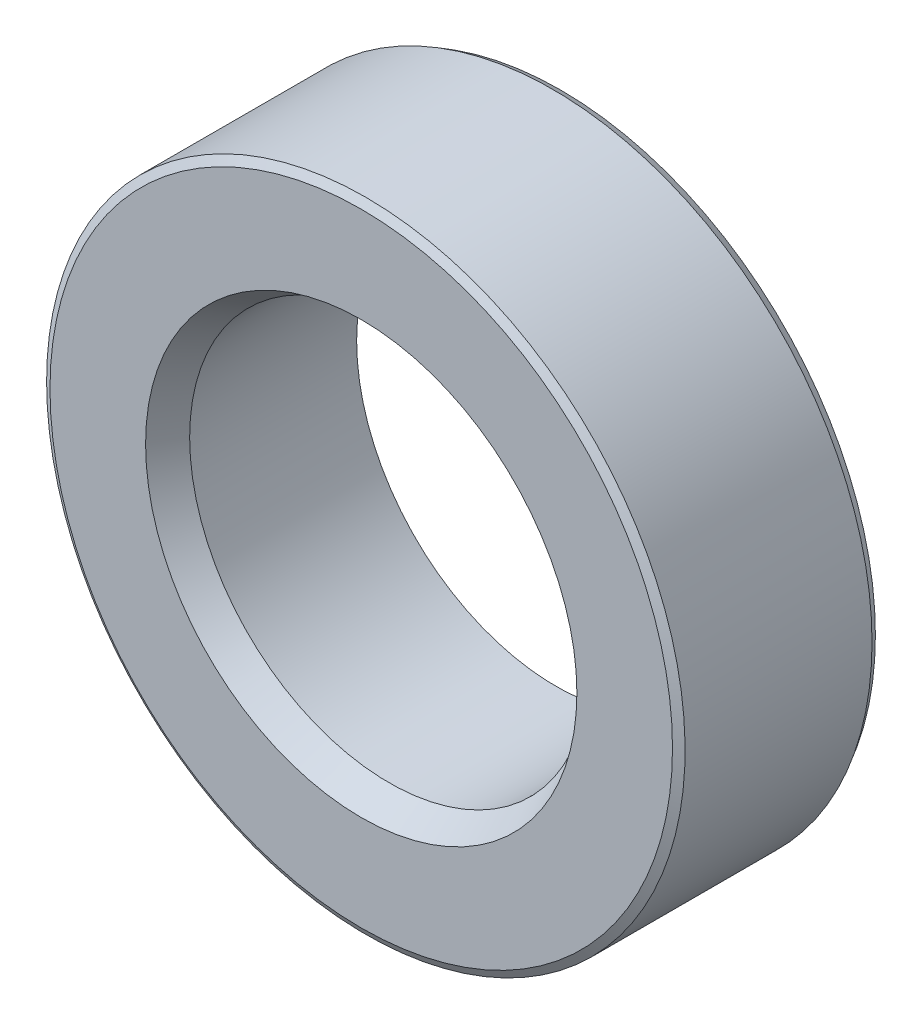
ISO-10303-21;
HEADER;
FILE_DESCRIPTION(('STEP AP214'),'2;1');
FILE_NAME('part.step','',(''),(''),'','','');
FILE_SCHEMA(('AUTOMOTIVE_DESIGN { 1 0 10303 214 1 1 1 1 }'));
ENDSEC;
DATA;
#1=APPLICATION_CONTEXT('core data for automotive mechanical design processes');
#2=APPLICATION_PROTOCOL_DEFINITION('international standard','automotive_design',2000,#1);
#3=PRODUCT_CONTEXT('',#1,'mechanical');
#4=PRODUCT('Part','Part','',(#3));
#5=PRODUCT_RELATED_PRODUCT_CATEGORY('part','',(#4));
#6=PRODUCT_DEFINITION_FORMATION('','',#4);
#7=PRODUCT_DEFINITION_CONTEXT('part definition',#1,'design');
#8=PRODUCT_DEFINITION('design','',#6,#7);
#9=PRODUCT_DEFINITION_SHAPE('','',#8);
#10=(LENGTH_UNIT() NAMED_UNIT(*) SI_UNIT(.MILLI.,.METRE.));
#11=(NAMED_UNIT(*) PLANE_ANGLE_UNIT() SI_UNIT($,.RADIAN.));
#12=(NAMED_UNIT(*) SI_UNIT($,.STERADIAN.) SOLID_ANGLE_UNIT());
#13=UNCERTAINTY_MEASURE_WITH_UNIT(LENGTH_MEASURE(1.E-05),#10,'distance_accuracy_value','');
#14=(GEOMETRIC_REPRESENTATION_CONTEXT(3) GLOBAL_UNCERTAINTY_ASSIGNED_CONTEXT((#13)) GLOBAL_UNIT_ASSIGNED_CONTEXT((#10,
#11,#12)) REPRESENTATION_CONTEXT('',''));
#15=CARTESIAN_POINT('',(0.,0.,0.));
#16=DIRECTION('',(0.,0.,1.));
#17=DIRECTION('',(1.,0.,0.));
#18=AXIS2_PLACEMENT_3D('',#15,#16,#17);
#19=CARTESIAN_POINT('',(0.,0.,-2.5));
#20=DIRECTION('',(0.,0.,-1.));
#21=DIRECTION('',(-1.,0.,0.));
#22=AXIS2_PLACEMENT_3D('',#19,#20,#21);
#23=CYLINDRICAL_SURFACE('',#22,2.5);
#24=CARTESIAN_POINT('',(0.,0.,-0.100000000031741));
#25=DIRECTION('',(0.,0.,1.));
#26=DIRECTION('',(-1.,0.,0.));
#27=AXIS2_PLACEMENT_3D('',#24,#25,#26);
#28=CIRCLE('',#27,2.50000000005457);
#29=CARTESIAN_POINT('',(-2.50000000005457,0.,-0.100000000031741));
#30=VERTEX_POINT('',#29);
#31=EDGE_CURVE('E35',#30,#30,#28,.T.);
#32=ORIENTED_EDGE('',*,*,#31,.T.);
#33=EDGE_LOOP('',(#32));
#34=FACE_BOUND('',#33,.T.);
#35=CARTESIAN_POINT('',(0.,0.,-2.19226497307545));
#36=DIRECTION('',(0.,0.,-1.));
#37=DIRECTION('',(1.,0.,0.));
#38=AXIS2_PLACEMENT_3D('',#35,#36,#37);
#39=CIRCLE('',#38,2.49999999999771);
#40=CARTESIAN_POINT('',(2.49999999999773,0.,-2.19226497307545));
#41=VERTEX_POINT('',#40);
#42=EDGE_CURVE('E32',#41,#41,#39,.T.);
#43=ORIENTED_EDGE('',*,*,#42,.T.);
#44=EDGE_LOOP('',(#43));
#45=FACE_BOUND('',#44,.T.);
#46=ADVANCED_FACE('F15',(#34,#45),#23,.F.);
#47=CARTESIAN_POINT('',(0.,0.,0.249999999880401));
#48=DIRECTION('',(0.,0.,1.));
#49=DIRECTION('',(1.,0.,0.));
#50=AXIS2_PLACEMENT_3D('',#47,#48,#49);
#51=CONICAL_SURFACE('',#50,2.70207259421795,0.523598775644934);
#52=CARTESIAN_POINT('',(0.,0.,0.249999999994088));
#53=DIRECTION('',(0.,0.,1.));
#54=DIRECTION('',(1.,0.,0.));
#55=AXIS2_PLACEMENT_3D('',#52,#53,#54);
#56=CIRCLE('',#55,2.70207259428359);
#57=CARTESIAN_POINT('',(2.70207259428359,0.,0.249999999994088));
#58=VERTEX_POINT('',#57);
#59=EDGE_CURVE('E18',#58,#58,#56,.F.);
#60=ORIENTED_EDGE('',*,*,#59,.F.);
#61=EDGE_LOOP('',(#60));
#62=FACE_BOUND('',#61,.T.);
#63=ORIENTED_EDGE('',*,*,#31,.F.);
#64=EDGE_LOOP('',(#63));
#65=FACE_BOUND('',#64,.T.);
#66=ADVANCED_FACE('F52',(#62,#65),#51,.F.);
#67=CARTESIAN_POINT('',(0.,0.,-2.25000000000364));
#68=DIRECTION('',(0.,0.,-1.));
#69=DIRECTION('',(-1.,0.,0.));
#70=AXIS2_PLACEMENT_3D('',#67,#68,#69);
#71=CONICAL_SURFACE('',#70,2.60000000002945,1.04719755133083);
#72=CARTESIAN_POINT('',(0.,0.,-2.25000000000365));
#73=DIRECTION('',(0.,0.,-1.));
#74=DIRECTION('',(-1.,0.,0.));
#75=AXIS2_PLACEMENT_3D('',#72,#73,#74);
#76=CIRCLE('',#75,2.60000000002947);
#77=CARTESIAN_POINT('',(-2.60000000002945,0.,-2.25000000000365));
#78=VERTEX_POINT('',#77);
#79=EDGE_CURVE('E42',#78,#78,#76,.T.);
#80=ORIENTED_EDGE('',*,*,#79,.T.);
#81=EDGE_LOOP('',(#80));
#82=FACE_BOUND('',#81,.T.);
#83=ORIENTED_EDGE('',*,*,#42,.F.);
#84=EDGE_LOOP('',(#83));
#85=FACE_BOUND('',#84,.T.);
#86=ADVANCED_FACE('F55',(#82,#85),#71,.F.);
#87=CARTESIAN_POINT('',(0.,0.,0.249999999999986));
#88=DIRECTION('',(0.,0.,1.));
#89=DIRECTION('',(0.,-1.,0.));
#90=AXIS2_PLACEMENT_3D('',#87,#88,#89);
#91=PLANE('',#90);
#92=ORIENTED_EDGE('',*,*,#59,.T.);
#93=EDGE_LOOP('',(#92));
#94=FACE_BOUND('',#93,.T.);
#95=CARTESIAN_POINT('',(0.,0.,0.250000000009319));
#96=DIRECTION('',(0.,0.,-1.));
#97=DIRECTION('',(0.,1.,0.));
#98=AXIS2_PLACEMENT_3D('',#95,#96,#97);
#99=CIRCLE('',#98,3.89999999993051);
#100=CARTESIAN_POINT('',(0.,3.89999999993048,0.250000000009319));
#101=VERTEX_POINT('',#100);
#102=EDGE_CURVE('E40',#101,#101,#99,.T.);
#103=ORIENTED_EDGE('',*,*,#102,.F.);
#104=EDGE_LOOP('',(#103));
#105=FACE_BOUND('',#104,.T.);
#106=ADVANCED_FACE('F49',(#94,#105),#91,.T.);
#107=CARTESIAN_POINT('',(0.,0.,-2.25000000000001));
#108=DIRECTION('',(0.,0.,1.));
#109=DIRECTION('',(0.,-1.,0.));
#110=AXIS2_PLACEMENT_3D('',#107,#108,#109);
#111=PLANE('',#110);
#112=ORIENTED_EDGE('',*,*,#79,.F.);
#113=EDGE_LOOP('',(#112));
#114=FACE_BOUND('',#113,.T.);
#115=CARTESIAN_POINT('',(0.,0.,-2.25000000006048));
#116=DIRECTION('',(0.,0.,1.));
#117=DIRECTION('',(1.,0.,0.));
#118=AXIS2_PLACEMENT_3D('',#115,#116,#117);
#119=CIRCLE('',#118,3.94226497309093);
#120=CARTESIAN_POINT('',(3.94226497309095,0.,-2.25000000006048));
#121=VERTEX_POINT('',#120);
#122=EDGE_CURVE('E27',#121,#121,#119,.T.);
#123=ORIENTED_EDGE('',*,*,#122,.F.);
#124=EDGE_LOOP('',(#123));
#125=FACE_BOUND('',#124,.T.);
#126=ADVANCED_FACE('F68',(#114,#125),#111,.F.);
#127=CARTESIAN_POINT('',(0.,0.,0.192264973122747));
#128=DIRECTION('',(0.,0.,-1.));
#129=DIRECTION('',(0.,1.,0.));
#130=AXIS2_PLACEMENT_3D('',#127,#128,#129);
#131=CONICAL_SURFACE('',#130,3.99999999984857,1.04719755108469);
#132=ORIENTED_EDGE('',*,*,#102,.T.);
#133=EDGE_LOOP('',(#132));
#134=FACE_BOUND('',#133,.T.);
#135=CARTESIAN_POINT('',(0.,0.,0.192264973081025));
#136=DIRECTION('',(0.,0.,-1.));
#137=DIRECTION('',(-1.,0.,0.));
#138=AXIS2_PLACEMENT_3D('',#135,#136,#137);
#139=CIRCLE('',#138,4.);
#140=CARTESIAN_POINT('',(-4.,0.,0.192264973081025));
#141=VERTEX_POINT('',#140);
#142=EDGE_CURVE('E22',#141,#141,#139,.T.);
#143=ORIENTED_EDGE('',*,*,#142,.F.);
#144=EDGE_LOOP('',(#143));
#145=FACE_BOUND('',#144,.T.);
#146=ADVANCED_FACE('F77',(#134,#145),#131,.T.);
#147=CARTESIAN_POINT('',(0.,0.,-2.1499999999719));
#148=DIRECTION('',(0.,0.,1.));
#149=DIRECTION('',(1.,0.,0.));
#150=AXIS2_PLACEMENT_3D('',#147,#148,#149);
#151=CONICAL_SURFACE('',#150,4.00000000007596,0.52359877571021);
#152=ORIENTED_EDGE('',*,*,#122,.T.);
#153=EDGE_LOOP('',(#152));
#154=FACE_BOUND('',#153,.T.);
#155=CARTESIAN_POINT('',(0.,0.,-2.15000000000001));
#156=DIRECTION('',(0.,0.,-1.));
#157=DIRECTION('',(-1.,0.,0.));
#158=AXIS2_PLACEMENT_3D('',#155,#156,#157);
#159=CIRCLE('',#158,4.);
#160=CARTESIAN_POINT('',(-4.,0.,-2.15000000000001));
#161=VERTEX_POINT('',#160);
#162=EDGE_CURVE('E10',#161,#161,#159,.F.);
#163=ORIENTED_EDGE('',*,*,#162,.F.);
#164=EDGE_LOOP('',(#163));
#165=FACE_BOUND('',#164,.T.);
#166=ADVANCED_FACE('F72',(#154,#165),#151,.T.);
#167=CARTESIAN_POINT('',(0.,0.,-2.5));
#168=DIRECTION('',(0.,0.,-1.));
#169=DIRECTION('',(-1.,0.,0.));
#170=AXIS2_PLACEMENT_3D('',#167,#168,#169);
#171=CYLINDRICAL_SURFACE('',#170,4.);
#172=ORIENTED_EDGE('',*,*,#162,.T.);
#173=EDGE_LOOP('',(#172));
#174=FACE_BOUND('',#173,.T.);
#175=ORIENTED_EDGE('',*,*,#142,.T.);
#176=EDGE_LOOP('',(#175));
#177=FACE_BOUND('',#176,.T.);
#178=ADVANCED_FACE('F70',(#174,#177),#171,.T.);
#179=CLOSED_SHELL('',(#46,#66,#86,#106,#126,#146,#166,#178));
#180=MANIFOLD_SOLID_BREP('B1',#179);
#181=ADVANCED_BREP_SHAPE_REPRESENTATION('',(#18,#180),#14);
#182=SHAPE_DEFINITION_REPRESENTATION(#9,#181);
ENDSEC;
END-ISO-10303-21;
